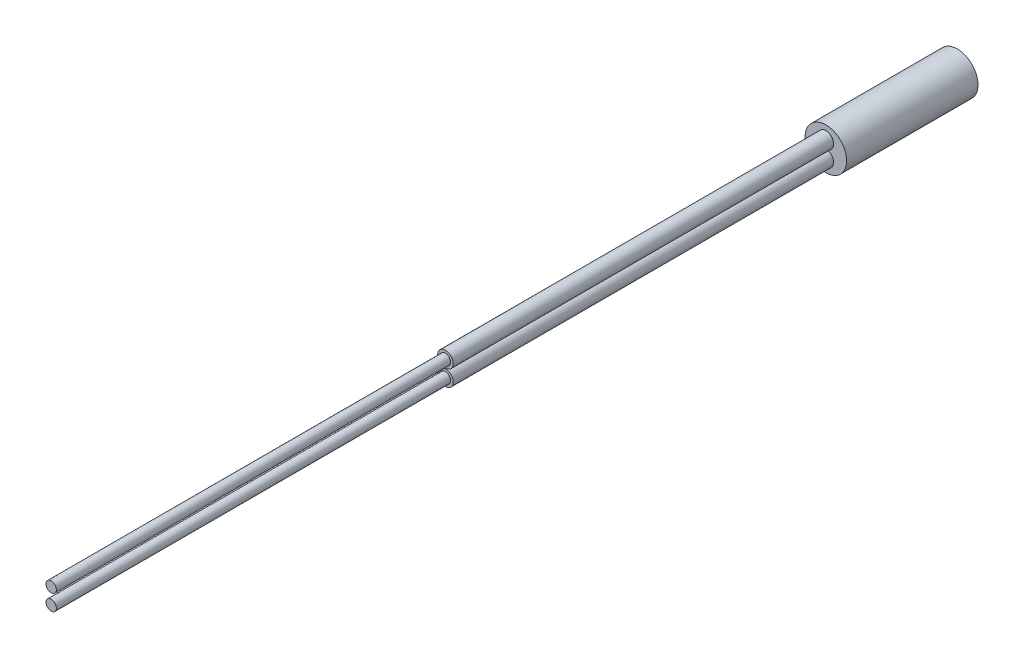
ISO-10303-21;
HEADER;
FILE_DESCRIPTION(('STEP AP214'),'2;1');
FILE_NAME('part.step','',(''),(''),'','','');
FILE_SCHEMA(('AUTOMOTIVE_DESIGN { 1 0 10303 214 1 1 1 1 }'));
ENDSEC;
DATA;
#1=APPLICATION_CONTEXT('core data for automotive mechanical design processes');
#2=APPLICATION_PROTOCOL_DEFINITION('international standard','automotive_design',2000,#1);
#3=PRODUCT_CONTEXT('',#1,'mechanical');
#4=PRODUCT('Part','Part','',(#3));
#5=PRODUCT_RELATED_PRODUCT_CATEGORY('part','',(#4));
#6=PRODUCT_DEFINITION_FORMATION('','',#4);
#7=PRODUCT_DEFINITION_CONTEXT('part definition',#1,'design');
#8=PRODUCT_DEFINITION('design','',#6,#7);
#9=PRODUCT_DEFINITION_SHAPE('','',#8);
#10=(LENGTH_UNIT() NAMED_UNIT(*) SI_UNIT(.MILLI.,.METRE.));
#11=(NAMED_UNIT(*) PLANE_ANGLE_UNIT() SI_UNIT($,.RADIAN.));
#12=(NAMED_UNIT(*) SI_UNIT($,.STERADIAN.) SOLID_ANGLE_UNIT());
#13=UNCERTAINTY_MEASURE_WITH_UNIT(LENGTH_MEASURE(1.E-05),#10,'distance_accuracy_value','');
#14=(GEOMETRIC_REPRESENTATION_CONTEXT(3) GLOBAL_UNCERTAINTY_ASSIGNED_CONTEXT((#13)) GLOBAL_UNIT_ASSIGNED_CONTEXT((#10,
#11,#12)) REPRESENTATION_CONTEXT('',''));
#15=CARTESIAN_POINT('',(0.,0.,0.));
#16=DIRECTION('',(0.,0.,1.));
#17=DIRECTION('',(1.,0.,0.));
#18=AXIS2_PLACEMENT_3D('',#15,#16,#17);
#19=CARTESIAN_POINT('',(0.,1.15,76.5));
#20=DIRECTION('',(0.,0.,1.));
#21=DIRECTION('',(1.,0.,0.));
#22=AXIS2_PLACEMENT_3D('',#19,#20,#21);
#23=PLANE('',#22);
#24=CARTESIAN_POINT('',(0.,1.15,76.5));
#25=DIRECTION('',(0.,0.,1.));
#26=DIRECTION('',(1.,0.,0.));
#27=AXIS2_PLACEMENT_3D('',#24,#25,#26);
#28=CIRCLE('',#27,1.125);
#29=CARTESIAN_POINT('',(1.125,1.15,76.5));
#30=VERTEX_POINT('',#29);
#31=EDGE_CURVE('E55',#30,#30,#28,.T.);
#32=ORIENTED_EDGE('',*,*,#31,.T.);
#33=EDGE_LOOP('',(#32));
#34=FACE_BOUND('',#33,.T.);
#35=CARTESIAN_POINT('',(0.,1.15,76.5));
#36=DIRECTION('',(0.,0.,1.));
#37=DIRECTION('',(1.,0.,0.));
#38=AXIS2_PLACEMENT_3D('',#35,#36,#37);
#39=CIRCLE('',#38,0.75);
#40=CARTESIAN_POINT('',(0.75,1.15,76.5));
#41=VERTEX_POINT('',#40);
#42=EDGE_CURVE('E36',#41,#41,#39,.F.);
#43=ORIENTED_EDGE('',*,*,#42,.T.);
#44=EDGE_LOOP('',(#43));
#45=FACE_BOUND('',#44,.T.);
#46=ADVANCED_FACE('F32',(#34,#45),#23,.T.);
#47=CARTESIAN_POINT('',(0.,-1.15,76.5));
#48=DIRECTION('',(0.,0.,1.));
#49=DIRECTION('',(1.,0.,0.));
#50=AXIS2_PLACEMENT_3D('',#47,#48,#49);
#51=PLANE('',#50);
#52=CARTESIAN_POINT('',(0.,-1.15,76.5));
#53=DIRECTION('',(0.,0.,1.));
#54=DIRECTION('',(1.,0.,0.));
#55=AXIS2_PLACEMENT_3D('',#52,#53,#54);
#56=CIRCLE('',#55,1.125);
#57=CARTESIAN_POINT('',(1.125,-1.15,76.5));
#58=VERTEX_POINT('',#57);
#59=EDGE_CURVE('E45',#58,#58,#56,.T.);
#60=ORIENTED_EDGE('',*,*,#59,.T.);
#61=EDGE_LOOP('',(#60));
#62=FACE_BOUND('',#61,.T.);
#63=CARTESIAN_POINT('',(0.,-1.15,76.5));
#64=DIRECTION('',(0.,0.,1.));
#65=DIRECTION('',(1.,0.,0.));
#66=AXIS2_PLACEMENT_3D('',#63,#64,#65);
#67=CIRCLE('',#66,0.75);
#68=CARTESIAN_POINT('',(0.75,-1.15,76.5));
#69=VERTEX_POINT('',#68);
#70=EDGE_CURVE('E48',#69,#69,#67,.F.);
#71=ORIENTED_EDGE('',*,*,#70,.T.);
#72=EDGE_LOOP('',(#71));
#73=FACE_BOUND('',#72,.T.);
#74=ADVANCED_FACE('F76',(#62,#73),#51,.T.);
#75=CARTESIAN_POINT('',(0.,0.,21.5));
#76=DIRECTION('',(0.,0.,1.));
#77=DIRECTION('',(1.,0.,0.));
#78=AXIS2_PLACEMENT_3D('',#75,#76,#77);
#79=PLANE('',#78);
#80=CARTESIAN_POINT('',(0.,-1.15,21.5));
#81=DIRECTION('',(0.,0.,1.));
#82=DIRECTION('',(1.,0.,0.));
#83=AXIS2_PLACEMENT_3D('',#80,#81,#82);
#84=CIRCLE('',#83,1.125);
#85=CARTESIAN_POINT('',(1.125,-1.15,21.5));
#86=VERTEX_POINT('',#85);
#87=EDGE_CURVE('E66',#86,#86,#84,.T.);
#88=ORIENTED_EDGE('',*,*,#87,.F.);
#89=EDGE_LOOP('',(#88));
#90=FACE_BOUND('',#89,.T.);
#91=CARTESIAN_POINT('',(0.,0.,21.5));
#92=DIRECTION('',(0.,0.,1.));
#93=DIRECTION('',(1.,0.,0.));
#94=AXIS2_PLACEMENT_3D('',#91,#92,#93);
#95=CIRCLE('',#94,3.);
#96=CARTESIAN_POINT('',(3.,0.,21.5));
#97=VERTEX_POINT('',#96);
#98=EDGE_CURVE('E10',#97,#97,#95,.T.);
#99=ORIENTED_EDGE('',*,*,#98,.T.);
#100=EDGE_LOOP('',(#99));
#101=FACE_BOUND('',#100,.T.);
#102=CARTESIAN_POINT('',(0.,1.15,21.5));
#103=DIRECTION('',(0.,0.,1.));
#104=DIRECTION('',(1.,0.,0.));
#105=AXIS2_PLACEMENT_3D('',#102,#103,#104);
#106=CIRCLE('',#105,1.125);
#107=CARTESIAN_POINT('',(1.125,1.15,21.5));
#108=VERTEX_POINT('',#107);
#109=EDGE_CURVE('E50',#108,#108,#106,.T.);
#110=ORIENTED_EDGE('',*,*,#109,.F.);
#111=EDGE_LOOP('',(#110));
#112=FACE_BOUND('',#111,.T.);
#113=ADVANCED_FACE('F74',(#90,#101,#112),#79,.T.);
#114=CARTESIAN_POINT('',(0.,0.,18.));
#115=DIRECTION('',(0.,0.,-1.));
#116=DIRECTION('',(-1.,0.,0.));
#117=AXIS2_PLACEMENT_3D('',#114,#115,#116);
#118=CYLINDRICAL_SURFACE('',#117,3.);
#119=ORIENTED_EDGE('',*,*,#98,.F.);
#120=EDGE_LOOP('',(#119));
#121=FACE_BOUND('',#120,.T.);
#122=CARTESIAN_POINT('',(0.,0.,2.5));
#123=DIRECTION('',(0.,0.,-1.));
#124=DIRECTION('',(-1.,0.,0.));
#125=AXIS2_PLACEMENT_3D('',#122,#123,#124);
#126=CIRCLE('',#125,3.);
#127=CARTESIAN_POINT('',(-3.,0.,2.5));
#128=VERTEX_POINT('',#127);
#129=EDGE_CURVE('E40',#128,#128,#126,.T.);
#130=ORIENTED_EDGE('',*,*,#129,.F.);
#131=EDGE_LOOP('',(#130));
#132=FACE_BOUND('',#131,.T.);
#133=ADVANCED_FACE('F34',(#121,#132),#118,.T.);
#134=CARTESIAN_POINT('',(0.,0.,2.5));
#135=DIRECTION('',(0.,0.,-1.));
#136=DIRECTION('',(-1.,0.,0.));
#137=AXIS2_PLACEMENT_3D('',#134,#135,#136);
#138=PLANE('',#137);
#139=ORIENTED_EDGE('',*,*,#129,.T.);
#140=EDGE_LOOP('',(#139));
#141=FACE_BOUND('',#140,.T.);
#142=ADVANCED_FACE('F92',(#141),#138,.T.);
#143=CARTESIAN_POINT('',(0.,-1.15,76.5));
#144=DIRECTION('',(0.,0.,-1.));
#145=DIRECTION('',(-1.,0.,0.));
#146=AXIS2_PLACEMENT_3D('',#143,#144,#145);
#147=CYLINDRICAL_SURFACE('',#146,1.125);
#148=ORIENTED_EDGE('',*,*,#59,.F.);
#149=EDGE_LOOP('',(#148));
#150=FACE_BOUND('',#149,.T.);
#151=ORIENTED_EDGE('',*,*,#87,.T.);
#152=EDGE_LOOP('',(#151));
#153=FACE_BOUND('',#152,.T.);
#154=ADVANCED_FACE('F72',(#150,#153),#147,.T.);
#155=CARTESIAN_POINT('',(0.,1.15,76.5));
#156=DIRECTION('',(0.,0.,-1.));
#157=DIRECTION('',(-1.,0.,0.));
#158=AXIS2_PLACEMENT_3D('',#155,#156,#157);
#159=CYLINDRICAL_SURFACE('',#158,1.125);
#160=ORIENTED_EDGE('',*,*,#31,.F.);
#161=EDGE_LOOP('',(#160));
#162=FACE_BOUND('',#161,.T.);
#163=ORIENTED_EDGE('',*,*,#109,.T.);
#164=EDGE_LOOP('',(#163));
#165=FACE_BOUND('',#164,.T.);
#166=ADVANCED_FACE('F80',(#162,#165),#159,.T.);
#167=CARTESIAN_POINT('',(0.,-1.15,133.5));
#168=DIRECTION('',(0.,0.,-1.));
#169=DIRECTION('',(-1.,0.,0.));
#170=AXIS2_PLACEMENT_3D('',#167,#168,#169);
#171=CYLINDRICAL_SURFACE('',#170,0.75);
#172=ORIENTED_EDGE('',*,*,#70,.F.);
#173=EDGE_LOOP('',(#172));
#174=FACE_BOUND('',#173,.T.);
#175=CARTESIAN_POINT('',(0.,-1.15,133.5));
#176=DIRECTION('',(0.,0.,1.));
#177=DIRECTION('',(1.,0.,0.));
#178=AXIS2_PLACEMENT_3D('',#175,#176,#177);
#179=CIRCLE('',#178,0.75);
#180=CARTESIAN_POINT('',(0.75,-1.15,133.5));
#181=VERTEX_POINT('',#180);
#182=EDGE_CURVE('E51',#181,#181,#179,.T.);
#183=ORIENTED_EDGE('',*,*,#182,.F.);
#184=EDGE_LOOP('',(#183));
#185=FACE_BOUND('',#184,.T.);
#186=ADVANCED_FACE('F82',(#174,#185),#171,.T.);
#187=CARTESIAN_POINT('',(0.,-1.15,133.5));
#188=DIRECTION('',(0.,0.,1.));
#189=DIRECTION('',(1.,0.,0.));
#190=AXIS2_PLACEMENT_3D('',#187,#188,#189);
#191=PLANE('',#190);
#192=ORIENTED_EDGE('',*,*,#182,.T.);
#193=EDGE_LOOP('',(#192));
#194=FACE_BOUND('',#193,.T.);
#195=ADVANCED_FACE('F89',(#194),#191,.T.);
#196=CARTESIAN_POINT('',(0.,1.15,133.5));
#197=DIRECTION('',(0.,0.,-1.));
#198=DIRECTION('',(-1.,0.,0.));
#199=AXIS2_PLACEMENT_3D('',#196,#197,#198);
#200=CYLINDRICAL_SURFACE('',#199,0.75);
#201=ORIENTED_EDGE('',*,*,#42,.F.);
#202=EDGE_LOOP('',(#201));
#203=FACE_BOUND('',#202,.T.);
#204=CARTESIAN_POINT('',(0.,1.15,133.5));
#205=DIRECTION('',(0.,0.,1.));
#206=DIRECTION('',(1.,0.,0.));
#207=AXIS2_PLACEMENT_3D('',#204,#205,#206);
#208=CIRCLE('',#207,0.75);
#209=CARTESIAN_POINT('',(0.75,1.15,133.5));
#210=VERTEX_POINT('',#209);
#211=EDGE_CURVE('E62',#210,#210,#208,.T.);
#212=ORIENTED_EDGE('',*,*,#211,.F.);
#213=EDGE_LOOP('',(#212));
#214=FACE_BOUND('',#213,.T.);
#215=ADVANCED_FACE('F108',(#203,#214),#200,.T.);
#216=CARTESIAN_POINT('',(0.,1.15,133.5));
#217=DIRECTION('',(0.,0.,1.));
#218=DIRECTION('',(1.,0.,0.));
#219=AXIS2_PLACEMENT_3D('',#216,#217,#218);
#220=PLANE('',#219);
#221=ORIENTED_EDGE('',*,*,#211,.T.);
#222=EDGE_LOOP('',(#221));
#223=FACE_BOUND('',#222,.T.);
#224=ADVANCED_FACE('F111',(#223),#220,.T.);
#225=CLOSED_SHELL('',(#46,#74,#113,#133,#142,#154,#166,#186,#195,#215,#224));
#226=MANIFOLD_SOLID_BREP('B2',#225);
#227=ADVANCED_BREP_SHAPE_REPRESENTATION('',(#18,#226),#14);
#228=SHAPE_DEFINITION_REPRESENTATION(#9,#227);
ENDSEC;
END-ISO-10303-21;
